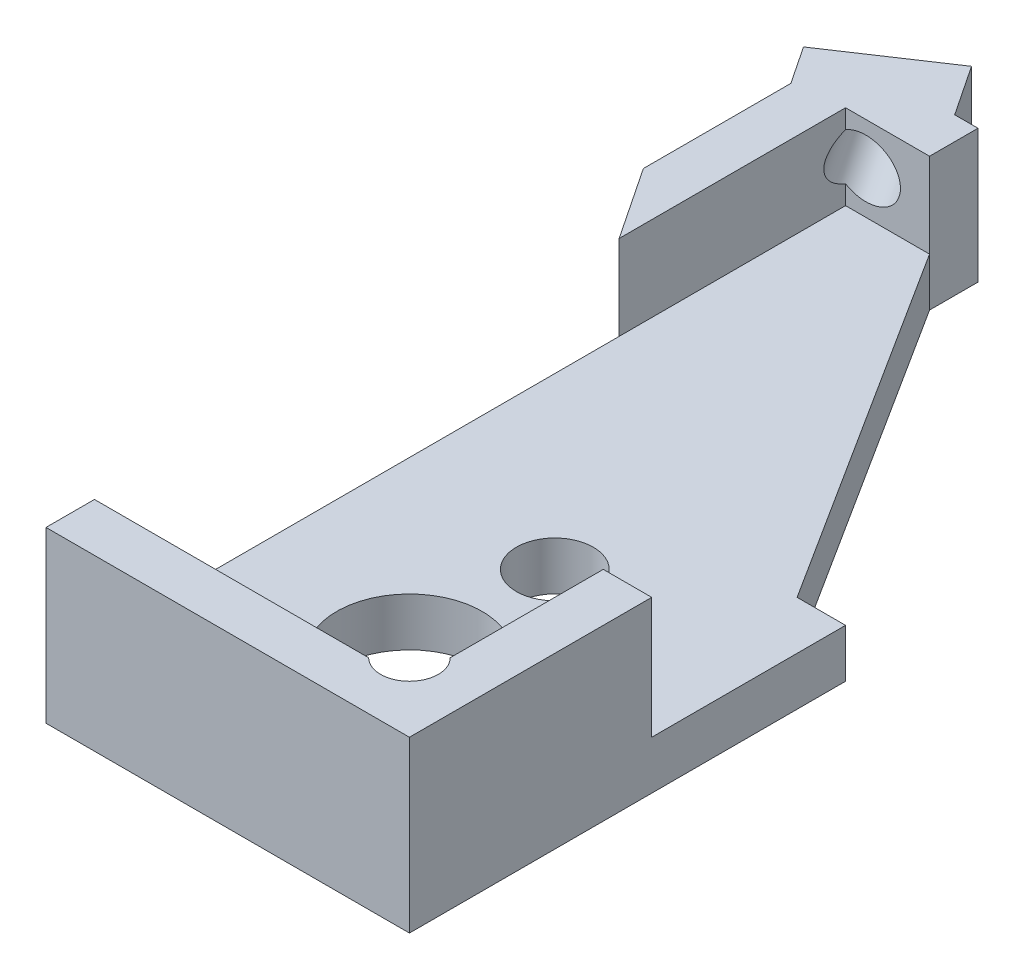
ISO-10303-21;
HEADER;
FILE_DESCRIPTION(('STEP AP214'),'2;1');
FILE_NAME('part.step','',(''),(''),'','','');
FILE_SCHEMA(('AUTOMOTIVE_DESIGN { 1 0 10303 214 1 1 1 1 }'));
ENDSEC;
DATA;
#1=APPLICATION_CONTEXT('core data for automotive mechanical design processes');
#2=APPLICATION_PROTOCOL_DEFINITION('international standard','automotive_design',2000,#1);
#3=PRODUCT_CONTEXT('',#1,'mechanical');
#4=PRODUCT('Part','Part','',(#3));
#5=PRODUCT_RELATED_PRODUCT_CATEGORY('part','',(#4));
#6=PRODUCT_DEFINITION_FORMATION('','',#4);
#7=PRODUCT_DEFINITION_CONTEXT('part definition',#1,'design');
#8=PRODUCT_DEFINITION('design','',#6,#7);
#9=PRODUCT_DEFINITION_SHAPE('','',#8);
#10=(LENGTH_UNIT() NAMED_UNIT(*) SI_UNIT(.MILLI.,.METRE.));
#11=(NAMED_UNIT(*) PLANE_ANGLE_UNIT() SI_UNIT($,.RADIAN.));
#12=(NAMED_UNIT(*) SI_UNIT($,.STERADIAN.) SOLID_ANGLE_UNIT());
#13=UNCERTAINTY_MEASURE_WITH_UNIT(LENGTH_MEASURE(1.E-05),#10,'distance_accuracy_value','');
#14=(GEOMETRIC_REPRESENTATION_CONTEXT(3) GLOBAL_UNCERTAINTY_ASSIGNED_CONTEXT((#13)) GLOBAL_UNIT_ASSIGNED_CONTEXT((#10,
#11,#12)) REPRESENTATION_CONTEXT('',''));
#15=CARTESIAN_POINT('',(0.,0.,0.));
#16=DIRECTION('',(0.,0.,1.));
#17=DIRECTION('',(1.,0.,0.));
#18=AXIS2_PLACEMENT_3D('',#15,#16,#17);
#19=CARTESIAN_POINT('',(-4.25,3.5,-8.75));
#20=DIRECTION('',(1.,0.,0.));
#21=DIRECTION('',(0.,0.,-1.));
#22=AXIS2_PLACEMENT_3D('',#19,#20,#21);
#23=PLANE('',#22);
#24=DIRECTION('',(0.,0.,1.));
#25=VECTOR('',#24,1.);
#26=CARTESIAN_POINT('',(-4.25,0.,-8.75));
#27=LINE('',#26,#25);
#28=CARTESIAN_POINT('',(-4.25,0.,-7.62166032803722));
#29=VERTEX_POINT('',#28);
#30=CARTESIAN_POINT('',(-4.25,0.,-4.57758298094113));
#31=VERTEX_POINT('',#30);
#32=EDGE_CURVE('E316',#29,#31,#27,.T.);
#33=ORIENTED_EDGE('',*,*,#32,.T.);
#34=DIRECTION('',(0.,1.,0.));
#35=VECTOR('',#34,1.);
#36=CARTESIAN_POINT('',(-4.25,-0.001000000000001,-4.57758298094113));
#37=LINE('',#36,#35);
#38=CARTESIAN_POINT('',(-4.25,2.75,-4.57758298094114));
#39=VERTEX_POINT('',#38);
#40=EDGE_CURVE('E221',#31,#39,#37,.T.);
#41=ORIENTED_EDGE('',*,*,#40,.T.);
#42=DIRECTION('',(0.,0.,-1.));
#43=VECTOR('',#42,1.);
#44=CARTESIAN_POINT('',(-4.25,2.75,-8.75));
#45=LINE('',#44,#43);
#46=CARTESIAN_POINT('',(-4.25,2.75,-7.62166032803722));
#47=VERTEX_POINT('',#46);
#48=EDGE_CURVE('E249',#39,#47,#45,.T.);
#49=ORIENTED_EDGE('',*,*,#48,.T.);
#50=DIRECTION('',(0.,-1.,0.));
#51=VECTOR('',#50,1.);
#52=CARTESIAN_POINT('',(-4.25,3.5,-7.62166032803722));
#53=LINE('',#52,#51);
#54=EDGE_CURVE('E272',#47,#29,#53,.T.);
#55=ORIENTED_EDGE('',*,*,#54,.T.);
#56=EDGE_LOOP('',(#33,#41,#49,#55));
#57=FACE_BOUND('',#56,.T.);
#58=ADVANCED_FACE('F37',(#57),#23,.F.);
#59=CARTESIAN_POINT('',(4.25,3.5,8.75));
#60=DIRECTION('',(0.,0.,-1.));
#61=DIRECTION('',(-1.,0.,0.));
#62=AXIS2_PLACEMENT_3D('',#59,#60,#61);
#63=PLANE('',#62);
#64=DIRECTION('',(1.,0.,0.));
#65=VECTOR('',#64,1.);
#66=CARTESIAN_POINT('',(4.25,3.5,8.75));
#67=LINE('',#66,#65);
#68=CARTESIAN_POINT('',(-3.24962944689039,3.5,8.75));
#69=VERTEX_POINT('',#68);
#70=CARTESIAN_POINT('',(4.25,3.5,8.75));
#71=VERTEX_POINT('',#70);
#72=EDGE_CURVE('E324',#69,#71,#67,.T.);
#73=ORIENTED_EDGE('',*,*,#72,.F.);
#74=DIRECTION('',(0.,1.,0.));
#75=VECTOR('',#74,1.);
#76=CARTESIAN_POINT('',(-3.24962944689039,-0.001000000000001,8.75));
#77=LINE('',#76,#75);
#78=CARTESIAN_POINT('',(-3.24962944689039,0.,8.75));
#79=VERTEX_POINT('',#78);
#80=EDGE_CURVE('E218',#79,#69,#77,.T.);
#81=ORIENTED_EDGE('',*,*,#80,.F.);
#82=DIRECTION('',(1.,0.,0.));
#83=VECTOR('',#82,1.);
#84=CARTESIAN_POINT('',(4.25,0.,8.75));
#85=LINE('',#84,#83);
#86=CARTESIAN_POINT('',(4.25,0.,8.75));
#87=VERTEX_POINT('',#86);
#88=EDGE_CURVE('E333',#79,#87,#85,.T.);
#89=ORIENTED_EDGE('',*,*,#88,.T.);
#90=DIRECTION('',(0.,-1.,0.));
#91=VECTOR('',#90,1.);
#92=CARTESIAN_POINT('',(4.25,3.5,8.75));
#93=LINE('',#92,#91);
#94=EDGE_CURVE('E330',#71,#87,#93,.T.);
#95=ORIENTED_EDGE('',*,*,#94,.F.);
#96=EDGE_LOOP('',(#73,#81,#89,#95));
#97=FACE_BOUND('',#96,.T.);
#98=ADVANCED_FACE('F408',(#97),#63,.F.);
#99=CARTESIAN_POINT('',(4.25,3.5,-8.75));
#100=DIRECTION('',(-1.,0.,0.));
#101=DIRECTION('',(0.,0.,1.));
#102=AXIS2_PLACEMENT_3D('',#99,#100,#101);
#103=PLANE('',#102);
#104=DIRECTION('',(0.,0.,-1.));
#105=VECTOR('',#104,1.);
#106=CARTESIAN_POINT('',(4.25,1.,-0.250000000000001));
#107=LINE('',#106,#105);
#108=CARTESIAN_POINT('',(4.25,1.,3.75));
#109=VERTEX_POINT('',#108);
#110=CARTESIAN_POINT('',(4.25,1.,-0.250000000000001));
#111=VERTEX_POINT('',#110);
#112=EDGE_CURVE('E51',#109,#111,#107,.T.);
#113=ORIENTED_EDGE('',*,*,#112,.F.);
#114=DIRECTION('',(0.,1.,0.));
#115=VECTOR('',#114,1.);
#116=CARTESIAN_POINT('',(4.25,1.,3.75));
#117=LINE('',#116,#115);
#118=CARTESIAN_POINT('',(4.25,3.5,3.75));
#119=VERTEX_POINT('',#118);
#120=EDGE_CURVE('E362',#109,#119,#117,.T.);
#121=ORIENTED_EDGE('',*,*,#120,.T.);
#122=DIRECTION('',(0.,0.,-1.));
#123=VECTOR('',#122,1.);
#124=CARTESIAN_POINT('',(4.25,3.5,-8.75));
#125=LINE('',#124,#123);
#126=EDGE_CURVE('E326',#71,#119,#125,.T.);
#127=ORIENTED_EDGE('',*,*,#126,.F.);
#128=ORIENTED_EDGE('',*,*,#94,.T.);
#129=DIRECTION('',(0.,0.,-1.));
#130=VECTOR('',#129,1.);
#131=CARTESIAN_POINT('',(4.25,0.,-8.75));
#132=LINE('',#131,#130);
#133=CARTESIAN_POINT('',(4.25,0.,-0.25));
#134=VERTEX_POINT('',#133);
#135=EDGE_CURVE('E335',#87,#134,#132,.T.);
#136=ORIENTED_EDGE('',*,*,#135,.T.);
#137=DIRECTION('',(0.,1.,0.));
#138=VECTOR('',#137,1.);
#139=CARTESIAN_POINT('',(4.25,-0.001000000000001,-0.250000000000001));
#140=LINE('',#139,#138);
#141=EDGE_CURVE('E205',#134,#111,#140,.T.);
#142=ORIENTED_EDGE('',*,*,#141,.T.);
#143=EDGE_LOOP('',(#113,#121,#127,#128,#136,#142));
#144=FACE_BOUND('',#143,.T.);
#145=ADVANCED_FACE('F410',(#144),#103,.F.);
#146=CARTESIAN_POINT('',(4.25,3.5,-8.75));
#147=DIRECTION('',(0.,0.,1.));
#148=DIRECTION('',(1.,0.,0.));
#149=AXIS2_PLACEMENT_3D('',#146,#147,#148);
#150=PLANE('',#149);
#151=DIRECTION('',(1.,0.,0.));
#152=VECTOR('',#151,1.);
#153=CARTESIAN_POINT('',(4.25,2.75,-8.75));
#154=LINE('',#153,#152);
#155=CARTESIAN_POINT('',(-1.99760038508853,2.75,-8.75));
#156=VERTEX_POINT('',#155);
#157=CARTESIAN_POINT('',(-1.51708677248769,2.75,-8.75));
#158=VERTEX_POINT('',#157);
#159=EDGE_CURVE('E243',#156,#158,#154,.T.);
#160=ORIENTED_EDGE('',*,*,#159,.T.);
#161=DIRECTION('',(0.,1.,0.));
#162=VECTOR('',#161,1.);
#163=CARTESIAN_POINT('',(-1.51708677248769,-0.001000000000001,-8.75));
#164=LINE('',#163,#162);
#165=CARTESIAN_POINT('',(-1.51708677248769,0.,-8.75));
#166=VERTEX_POINT('',#165);
#167=EDGE_CURVE('E59',#166,#158,#164,.T.);
#168=ORIENTED_EDGE('',*,*,#167,.F.);
#169=DIRECTION('',(-1.,0.,0.));
#170=VECTOR('',#169,1.);
#171=CARTESIAN_POINT('',(4.25,0.,-8.75));
#172=LINE('',#171,#170);
#173=CARTESIAN_POINT('',(-1.99760038508853,0.,-8.75));
#174=VERTEX_POINT('',#173);
#175=EDGE_CURVE('E327',#166,#174,#172,.T.);
#176=ORIENTED_EDGE('',*,*,#175,.T.);
#177=DIRECTION('',(0.,1.,0.));
#178=VECTOR('',#177,1.);
#179=CARTESIAN_POINT('',(-1.99760038508853,3.5,-8.75));
#180=LINE('',#179,#178);
#181=EDGE_CURVE('E269',#174,#156,#180,.T.);
#182=ORIENTED_EDGE('',*,*,#181,.T.);
#183=EDGE_LOOP('',(#160,#168,#176,#182));
#184=FACE_BOUND('',#183,.T.);
#185=ADVANCED_FACE('F450',(#184),#150,.F.);
#186=CARTESIAN_POINT('',(0.,3.5,0.));
#187=DIRECTION('',(0.,-1.,0.));
#188=DIRECTION('',(0.,0.,-1.));
#189=AXIS2_PLACEMENT_3D('',#186,#187,#188);
#190=PLANE('',#189);
#191=ORIENTED_EDGE('',*,*,#126,.T.);
#192=DIRECTION('',(1.,0.,0.));
#193=VECTOR('',#192,1.);
#194=CARTESIAN_POINT('',(4.25,3.5,3.75));
#195=LINE('',#194,#193);
#196=CARTESIAN_POINT('',(3.25,3.5,3.75));
#197=VERTEX_POINT('',#196);
#198=EDGE_CURVE('E354',#197,#119,#195,.T.);
#199=ORIENTED_EDGE('',*,*,#198,.F.);
#200=DIRECTION('',(0.,0.,-1.));
#201=VECTOR('',#200,1.);
#202=CARTESIAN_POINT('',(3.25,3.5,-7.75));
#203=LINE('',#202,#201);
#204=CARTESIAN_POINT('',(3.25,3.5,6.90810098864976));
#205=VERTEX_POINT('',#204);
#206=EDGE_CURVE('E306',#205,#197,#203,.T.);
#207=ORIENTED_EDGE('',*,*,#206,.F.);
#208=CARTESIAN_POINT('',(2.82905049432488,3.5,7.32905049432488));
#209=DIRECTION('',(0.,1.,0.));
#210=DIRECTION('',(0.,0.,1.));
#211=AXIS2_PLACEMENT_3D('',#208,#209,#210);
#212=CIRCLE('',#211,0.595312500000001);
#213=CARTESIAN_POINT('',(2.40810098864977,3.5,7.75));
#214=VERTEX_POINT('',#213);
#215=EDGE_CURVE('E290',#214,#205,#212,.T.);
#216=ORIENTED_EDGE('',*,*,#215,.F.);
#217=DIRECTION('',(1.,0.,0.));
#218=VECTOR('',#217,1.);
#219=CARTESIAN_POINT('',(3.25,3.5,7.75));
#220=LINE('',#219,#218);
#221=CARTESIAN_POINT('',(-3.24962944689039,3.5,7.75));
#222=VERTEX_POINT('',#221);
#223=EDGE_CURVE('E303',#222,#214,#220,.T.);
#224=ORIENTED_EDGE('',*,*,#223,.F.);
#225=DIRECTION('',(0.,0.,-1.));
#226=VECTOR('',#225,1.);
#227=CARTESIAN_POINT('',(-3.24962944689039,3.5,-3.07702715127672));
#228=LINE('',#227,#226);
#229=EDGE_CURVE('E215',#69,#222,#228,.T.);
#230=ORIENTED_EDGE('',*,*,#229,.F.);
#231=ORIENTED_EDGE('',*,*,#72,.T.);
#232=EDGE_LOOP('',(#191,#199,#207,#216,#224,#230,#231));
#233=FACE_BOUND('',#232,.T.);
#234=ADVANCED_FACE('F352',(#233),#190,.F.);
#235=CARTESIAN_POINT('',(0.,0.,0.));
#236=DIRECTION('',(0.,-1.,0.));
#237=DIRECTION('',(0.,0.,-1.));
#238=AXIS2_PLACEMENT_3D('',#235,#236,#237);
#239=PLANE('',#238);
#240=DIRECTION('',(0.,0.,1.));
#241=VECTOR('',#240,1.);
#242=CARTESIAN_POINT('',(-1.51708677248769,0.,-7.75));
#243=LINE('',#242,#241);
#244=CARTESIAN_POINT('',(-1.51708677248769,0.,-7.75));
#245=VERTEX_POINT('',#244);
#246=EDGE_CURVE('E368',#166,#245,#243,.T.);
#247=ORIENTED_EDGE('',*,*,#246,.T.);
#248=DIRECTION('',(0.536423654016749,0.,0.843948851181942));
#249=VECTOR('',#248,1.);
#250=CARTESIAN_POINT('',(3.25,0.,-0.250000000000001));
#251=LINE('',#250,#249);
#252=CARTESIAN_POINT('',(3.25,0.,-0.250000000000001));
#253=VERTEX_POINT('',#252);
#254=EDGE_CURVE('E371',#245,#253,#251,.T.);
#255=ORIENTED_EDGE('',*,*,#254,.T.);
#256=DIRECTION('',(1.,0.,0.));
#257=VECTOR('',#256,1.);
#258=CARTESIAN_POINT('',(4.25,0.,-0.250000000000001));
#259=LINE('',#258,#257);
#260=EDGE_CURVE('E197',#253,#134,#259,.T.);
#261=ORIENTED_EDGE('',*,*,#260,.T.);
#262=ORIENTED_EDGE('',*,*,#135,.F.);
#263=ORIENTED_EDGE('',*,*,#88,.F.);
#264=DIRECTION('',(0.,0.,-1.));
#265=VECTOR('',#264,1.);
#266=CARTESIAN_POINT('',(-3.24962944689039,0.,-3.07702715127672));
#267=LINE('',#266,#265);
#268=CARTESIAN_POINT('',(-3.24962944689039,0.,-3.07702715127672));
#269=VERTEX_POINT('',#268);
#270=EDGE_CURVE('E212',#79,#269,#267,.T.);
#271=ORIENTED_EDGE('',*,*,#270,.T.);
#272=DIRECTION('',(-0.554700196225229,0.,-0.832050294337844));
#273=VECTOR('',#272,1.);
#274=CARTESIAN_POINT('',(-4.25,0.,-4.57758298094113));
#275=LINE('',#274,#273);
#276=EDGE_CURVE('E229',#269,#31,#275,.T.);
#277=ORIENTED_EDGE('',*,*,#276,.T.);
#278=ORIENTED_EDGE('',*,*,#32,.F.);
#279=DIRECTION('',(0.554700196225229,0.,0.832050294337844));
#280=VECTOR('',#279,1.);
#281=CARTESIAN_POINT('',(-4.00154138705974,0.,-7.24897240862683));
#282=LINE('',#281,#280);
#283=CARTESIAN_POINT('',(-4.77077215629051,0.,-8.40281856247299));
#284=VERTEX_POINT('',#283);
#285=EDGE_CURVE('E262',#284,#29,#282,.T.);
#286=ORIENTED_EDGE('',*,*,#285,.F.);
#287=DIRECTION('',(-0.832050294337844,0.,0.554700196225229));
#288=VECTOR('',#287,1.);
#289=CARTESIAN_POINT('',(-2.6906464204459,0.,-9.78956905303606));
#290=LINE('',#289,#288);
#291=CARTESIAN_POINT('',(-2.6906464204459,0.,-9.78956905303606));
#292=VERTEX_POINT('',#291);
#293=EDGE_CURVE('E256',#292,#284,#290,.T.);
#294=ORIENTED_EDGE('',*,*,#293,.F.);
#295=DIRECTION('',(-0.55470019622523,0.,-0.832050294337843));
#296=VECTOR('',#295,1.);
#297=CARTESIAN_POINT('',(-2.6906464204459,0.,-9.78956905303606));
#298=LINE('',#297,#296);
#299=EDGE_CURVE('E259',#174,#292,#298,.T.);
#300=ORIENTED_EDGE('',*,*,#299,.F.);
#301=ORIENTED_EDGE('',*,*,#175,.F.);
#302=EDGE_LOOP('',(#247,#255,#261,#262,#263,#271,#277,#278,#286,#294,#300,#301));
#303=FACE_BOUND('',#302,.T.);
#304=CARTESIAN_POINT('',(2.125,0.,6.5));
#305=DIRECTION('',(0.,1.,0.));
#306=DIRECTION('',(0.,0.,1.));
#307=AXIS2_PLACEMENT_3D('',#304,#305,#306);
#308=CIRCLE('',#307,0.79375);
#309=CARTESIAN_POINT('',(2.125,0.,7.29375));
#310=VERTEX_POINT('',#309);
#311=EDGE_CURVE('E275',#310,#310,#308,.T.);
#312=ORIENTED_EDGE('',*,*,#311,.T.);
#313=EDGE_LOOP('',(#312));
#314=FACE_BOUND('',#313,.T.);
#315=CARTESIAN_POINT('',(-1.625,0.,6.5));
#316=DIRECTION('',(0.,1.,0.));
#317=DIRECTION('',(0.,0.,1.));
#318=AXIS2_PLACEMENT_3D('',#315,#316,#317);
#319=CIRCLE('',#318,0.793750000000001);
#320=CARTESIAN_POINT('',(-1.625,0.,7.29375));
#321=VERTEX_POINT('',#320);
#322=EDGE_CURVE('E281',#321,#321,#319,.T.);
#323=ORIENTED_EDGE('',*,*,#322,.T.);
#324=EDGE_LOOP('',(#323));
#325=FACE_BOUND('',#324,.T.);
#326=CARTESIAN_POINT('',(0.25,0.,1.75));
#327=DIRECTION('',(0.,1.,0.));
#328=DIRECTION('',(0.,0.,1.));
#329=AXIS2_PLACEMENT_3D('',#326,#327,#328);
#330=CIRCLE('',#329,0.79375);
#331=CARTESIAN_POINT('',(0.25,0.,2.54375));
#332=VERTEX_POINT('',#331);
#333=EDGE_CURVE('E287',#332,#332,#330,.T.);
#334=ORIENTED_EDGE('',*,*,#333,.T.);
#335=EDGE_LOOP('',(#334));
#336=FACE_BOUND('',#335,.T.);
#337=CARTESIAN_POINT('',(0.250000000000001,0.,4.75));
#338=DIRECTION('',(0.,1.,0.));
#339=DIRECTION('',(0.,0.,1.));
#340=AXIS2_PLACEMENT_3D('',#337,#338,#339);
#341=CIRCLE('',#340,1.5);
#342=CARTESIAN_POINT('',(0.250000000000001,0.,6.25));
#343=VERTEX_POINT('',#342);
#344=EDGE_CURVE('E300',#343,#343,#341,.T.);
#345=ORIENTED_EDGE('',*,*,#344,.T.);
#346=EDGE_LOOP('',(#345));
#347=FACE_BOUND('',#346,.T.);
#348=ADVANCED_FACE('F402',(#303,#314,#325,#336,#347),#239,.T.);
#349=CARTESIAN_POINT('',(0.,1.,0.));
#350=DIRECTION('',(0.,-1.,0.));
#351=DIRECTION('',(0.,0.,-1.));
#352=AXIS2_PLACEMENT_3D('',#349,#350,#351);
#353=PLANE('',#352);
#354=CARTESIAN_POINT('',(2.125,1.,6.5));
#355=DIRECTION('',(0.,1.,0.));
#356=DIRECTION('',(0.,0.,1.));
#357=AXIS2_PLACEMENT_3D('',#354,#355,#356);
#358=CIRCLE('',#357,0.79375);
#359=CARTESIAN_POINT('',(2.125,1.,7.29375));
#360=VERTEX_POINT('',#359);
#361=EDGE_CURVE('E274',#360,#360,#358,.T.);
#362=ORIENTED_EDGE('',*,*,#361,.F.);
#363=EDGE_LOOP('',(#362));
#364=FACE_BOUND('',#363,.T.);
#365=CARTESIAN_POINT('',(-1.625,1.,6.5));
#366=DIRECTION('',(0.,1.,0.));
#367=DIRECTION('',(0.,0.,1.));
#368=AXIS2_PLACEMENT_3D('',#365,#366,#367);
#369=CIRCLE('',#368,0.793750000000001);
#370=CARTESIAN_POINT('',(-1.625,1.,7.29375));
#371=VERTEX_POINT('',#370);
#372=EDGE_CURVE('E278',#371,#371,#369,.T.);
#373=ORIENTED_EDGE('',*,*,#372,.F.);
#374=EDGE_LOOP('',(#373));
#375=FACE_BOUND('',#374,.T.);
#376=CARTESIAN_POINT('',(0.25,1.,1.75));
#377=DIRECTION('',(0.,1.,0.));
#378=DIRECTION('',(0.,0.,1.));
#379=AXIS2_PLACEMENT_3D('',#376,#377,#378);
#380=CIRCLE('',#379,0.79375);
#381=CARTESIAN_POINT('',(0.25,1.,2.54375));
#382=VERTEX_POINT('',#381);
#383=EDGE_CURVE('E284',#382,#382,#380,.T.);
#384=ORIENTED_EDGE('',*,*,#383,.F.);
#385=EDGE_LOOP('',(#384));
#386=FACE_BOUND('',#385,.T.);
#387=CARTESIAN_POINT('',(0.250000000000001,1.,4.75));
#388=DIRECTION('',(0.,1.,0.));
#389=DIRECTION('',(0.,0.,1.));
#390=AXIS2_PLACEMENT_3D('',#387,#388,#389);
#391=CIRCLE('',#390,1.5);
#392=CARTESIAN_POINT('',(0.250000000000001,1.,6.25));
#393=VERTEX_POINT('',#392);
#394=EDGE_CURVE('E299',#393,#393,#391,.T.);
#395=ORIENTED_EDGE('',*,*,#394,.F.);
#396=EDGE_LOOP('',(#395));
#397=FACE_BOUND('',#396,.T.);
#398=DIRECTION('',(0.,0.,-1.));
#399=VECTOR('',#398,1.);
#400=CARTESIAN_POINT('',(3.25,1.,-7.75));
#401=LINE('',#400,#399);
#402=CARTESIAN_POINT('',(3.25,1.,6.90810098864976));
#403=VERTEX_POINT('',#402);
#404=CARTESIAN_POINT('',(3.25,1.,3.75));
#405=VERTEX_POINT('',#404);
#406=EDGE_CURVE('E312',#403,#405,#401,.T.);
#407=ORIENTED_EDGE('',*,*,#406,.T.);
#408=DIRECTION('',(1.,0.,0.));
#409=VECTOR('',#408,1.);
#410=CARTESIAN_POINT('',(4.25,1.,3.75));
#411=LINE('',#410,#409);
#412=EDGE_CURVE('E183',#405,#109,#411,.T.);
#413=ORIENTED_EDGE('',*,*,#412,.T.);
#414=ORIENTED_EDGE('',*,*,#112,.T.);
#415=DIRECTION('',(-1.,0.,0.));
#416=VECTOR('',#415,1.);
#417=CARTESIAN_POINT('',(4.25,1.,-0.250000000000001));
#418=LINE('',#417,#416);
#419=CARTESIAN_POINT('',(3.25,1.,-0.250000000000001));
#420=VERTEX_POINT('',#419);
#421=EDGE_CURVE('E174',#111,#420,#418,.T.);
#422=ORIENTED_EDGE('',*,*,#421,.T.);
#423=DIRECTION('',(0.536423654016749,0.,0.843948851181942));
#424=VECTOR('',#423,1.);
#425=CARTESIAN_POINT('',(3.25,1.,-0.250000000000001));
#426=LINE('',#425,#424);
#427=CARTESIAN_POINT('',(-1.51708677248769,1.,-7.75));
#428=VERTEX_POINT('',#427);
#429=EDGE_CURVE('E178',#428,#420,#426,.T.);
#430=ORIENTED_EDGE('',*,*,#429,.F.);
#431=DIRECTION('',(-1.,0.,0.));
#432=VECTOR('',#431,1.);
#433=CARTESIAN_POINT('',(3.25,1.,-7.75));
#434=LINE('',#433,#432);
#435=CARTESIAN_POINT('',(-3.25,1.,-7.75));
#436=VERTEX_POINT('',#435);
#437=EDGE_CURVE('E318',#428,#436,#434,.T.);
#438=ORIENTED_EDGE('',*,*,#437,.T.);
#439=DIRECTION('',(0.,0.,1.));
#440=VECTOR('',#439,1.);
#441=CARTESIAN_POINT('',(-3.25,1.,-7.75));
#442=LINE('',#441,#440);
#443=CARTESIAN_POINT('',(-3.25,1.,-3.07758298094113));
#444=VERTEX_POINT('',#443);
#445=EDGE_CURVE('E313',#436,#444,#442,.T.);
#446=ORIENTED_EDGE('',*,*,#445,.T.);
#447=DIRECTION('',(-0.554700196225229,0.,-0.832050294337844));
#448=VECTOR('',#447,1.);
#449=CARTESIAN_POINT('',(-4.25,1.,-4.57758298094113));
#450=LINE('',#449,#448);
#451=CARTESIAN_POINT('',(-3.24962944689039,1.,-3.07702715127672));
#452=VERTEX_POINT('',#451);
#453=EDGE_CURVE('E227',#452,#444,#450,.T.);
#454=ORIENTED_EDGE('',*,*,#453,.F.);
#455=DIRECTION('',(0.,0.,-1.));
#456=VECTOR('',#455,1.);
#457=CARTESIAN_POINT('',(-3.24962944689039,1.,-3.07702715127672));
#458=LINE('',#457,#456);
#459=CARTESIAN_POINT('',(-3.24962944689039,1.,7.75));
#460=VERTEX_POINT('',#459);
#461=EDGE_CURVE('E210',#460,#452,#458,.T.);
#462=ORIENTED_EDGE('',*,*,#461,.F.);
#463=DIRECTION('',(1.,0.,0.));
#464=VECTOR('',#463,1.);
#465=CARTESIAN_POINT('',(3.25,1.,7.75));
#466=LINE('',#465,#464);
#467=CARTESIAN_POINT('',(2.40810098864977,1.,7.75));
#468=VERTEX_POINT('',#467);
#469=EDGE_CURVE('E309',#460,#468,#466,.T.);
#470=ORIENTED_EDGE('',*,*,#469,.T.);
#471=CARTESIAN_POINT('',(2.82905049432488,1.,7.32905049432488));
#472=DIRECTION('',(0.,-1.,0.));
#473=DIRECTION('',(0.,0.,-1.));
#474=AXIS2_PLACEMENT_3D('',#471,#472,#473);
#475=CIRCLE('',#474,0.595312500000001);
#476=EDGE_CURVE('E294',#468,#403,#475,.F.);
#477=ORIENTED_EDGE('',*,*,#476,.T.);
#478=EDGE_LOOP('',(#407,#413,#414,#422,#430,#438,#446,#454,#462,#470,#477));
#479=FACE_BOUND('',#478,.T.);
#480=ADVANCED_FACE('F177',(#364,#375,#386,#397,#479),#353,.F.);
#481=CARTESIAN_POINT('',(3.25,-16.8077363139716,7.75));
#482=DIRECTION('',(0.,0.,1.));
#483=DIRECTION('',(1.,0.,0.));
#484=AXIS2_PLACEMENT_3D('',#481,#482,#483);
#485=PLANE('',#484);
#486=ORIENTED_EDGE('',*,*,#469,.F.);
#487=DIRECTION('',(0.,-1.,0.));
#488=VECTOR('',#487,1.);
#489=CARTESIAN_POINT('',(-3.24962944689039,-0.001000000000001,7.75));
#490=LINE('',#489,#488);
#491=EDGE_CURVE('E208',#222,#460,#490,.T.);
#492=ORIENTED_EDGE('',*,*,#491,.F.);
#493=ORIENTED_EDGE('',*,*,#223,.T.);
#494=DIRECTION('',(0.,1.,0.));
#495=VECTOR('',#494,1.);
#496=CARTESIAN_POINT('',(2.40810098864977,-0.68379802270047,7.75));
#497=LINE('',#496,#495);
#498=EDGE_CURVE('E296',#214,#468,#497,.F.);
#499=ORIENTED_EDGE('',*,*,#498,.T.);
#500=EDGE_LOOP('',(#486,#492,#493,#499));
#501=FACE_BOUND('',#500,.T.);
#502=ADVANCED_FACE('F415',(#501),#485,.F.);
#503=CARTESIAN_POINT('',(3.25,-16.8077363139716,-7.75));
#504=DIRECTION('',(1.,0.,0.));
#505=DIRECTION('',(0.,0.,-1.));
#506=AXIS2_PLACEMENT_3D('',#503,#504,#505);
#507=PLANE('',#506);
#508=ORIENTED_EDGE('',*,*,#206,.T.);
#509=DIRECTION('',(0.,1.,0.));
#510=VECTOR('',#509,1.);
#511=CARTESIAN_POINT('',(3.25,1.,3.75));
#512=LINE('',#511,#510);
#513=EDGE_CURVE('E365',#405,#197,#512,.T.);
#514=ORIENTED_EDGE('',*,*,#513,.F.);
#515=ORIENTED_EDGE('',*,*,#406,.F.);
#516=DIRECTION('',(0.,1.,0.));
#517=VECTOR('',#516,1.);
#518=CARTESIAN_POINT('',(3.25,-0.68379802270047,6.90810098864976));
#519=LINE('',#518,#517);
#520=EDGE_CURVE('E44',#403,#205,#519,.T.);
#521=ORIENTED_EDGE('',*,*,#520,.T.);
#522=EDGE_LOOP('',(#508,#514,#515,#521));
#523=FACE_BOUND('',#522,.T.);
#524=ADVANCED_FACE('F345',(#523),#507,.F.);
#525=CARTESIAN_POINT('',(3.25,-16.8077363139716,-7.75));
#526=DIRECTION('',(0.,0.,-1.));
#527=DIRECTION('',(-1.,0.,0.));
#528=AXIS2_PLACEMENT_3D('',#525,#526,#527);
#529=PLANE('',#528);
#530=ORIENTED_EDGE('',*,*,#437,.F.);
#531=DIRECTION('',(0.,-1.,0.));
#532=VECTOR('',#531,1.);
#533=CARTESIAN_POINT('',(-1.51708677248769,-0.001000000000001,-7.75));
#534=LINE('',#533,#532);
#535=CARTESIAN_POINT('',(-1.51708677248769,2.75,-7.75));
#536=VERTEX_POINT('',#535);
#537=EDGE_CURVE('E364',#536,#428,#534,.T.);
#538=ORIENTED_EDGE('',*,*,#537,.F.);
#539=DIRECTION('',(-1.,0.,0.));
#540=VECTOR('',#539,1.);
#541=CARTESIAN_POINT('',(3.25,2.75,-7.75));
#542=LINE('',#541,#540);
#543=CARTESIAN_POINT('',(-3.25,2.75,-7.75));
#544=VERTEX_POINT('',#543);
#545=EDGE_CURVE('E254',#536,#544,#542,.T.);
#546=ORIENTED_EDGE('',*,*,#545,.T.);
#547=DIRECTION('',(0.,1.,0.));
#548=VECTOR('',#547,1.);
#549=CARTESIAN_POINT('',(-3.25,-16.8077363139716,-7.75));
#550=LINE('',#549,#548);
#551=CARTESIAN_POINT('',(-3.25,2.35928589904808,-7.75));
#552=VERTEX_POINT('',#551);
#553=EDGE_CURVE('E320',#552,#544,#550,.T.);
#554=ORIENTED_EDGE('',*,*,#553,.F.);
#555=CARTESIAN_POINT('',(-2.83324674986519,1.875,-7.75));
#556=DIRECTION('',(0.,0.,-1.));
#557=DIRECTION('',(-1.,0.,0.));
#558=AXIS2_PLACEMENT_3D('',#555,#556,#557);
#559=ELLIPSE('',#558,0.715858168734871,0.595629999999999);
#560=CARTESIAN_POINT('',(-3.25,1.39071410095189,-7.75));
#561=VERTEX_POINT('',#560);
#562=EDGE_CURVE('E238',#552,#561,#559,.T.);
#563=ORIENTED_EDGE('',*,*,#562,.T.);
#564=EDGE_CURVE('E317',#436,#561,#550,.T.);
#565=ORIENTED_EDGE('',*,*,#564,.F.);
#566=EDGE_LOOP('',(#530,#538,#546,#554,#563,#565));
#567=FACE_BOUND('',#566,.T.);
#568=ADVANCED_FACE('F379',(#567),#529,.F.);
#569=CARTESIAN_POINT('',(-3.25,-16.8077363139716,-7.75));
#570=DIRECTION('',(-1.,0.,0.));
#571=DIRECTION('',(0.,0.,1.));
#572=AXIS2_PLACEMENT_3D('',#569,#570,#571);
#573=PLANE('',#572);
#574=DIRECTION('',(0.,0.,1.));
#575=VECTOR('',#574,1.);
#576=CARTESIAN_POINT('',(-3.25,2.75,-7.75));
#577=LINE('',#576,#575);
#578=CARTESIAN_POINT('',(-3.25,2.75,-3.07758298094113));
#579=VERTEX_POINT('',#578);
#580=EDGE_CURVE('E251',#544,#579,#577,.T.);
#581=ORIENTED_EDGE('',*,*,#580,.T.);
#582=DIRECTION('',(0.,1.,0.));
#583=VECTOR('',#582,1.);
#584=CARTESIAN_POINT('',(-3.25,-0.001000000000001,-3.07758298094113));
#585=LINE('',#584,#583);
#586=EDGE_CURVE('E193',#444,#579,#585,.T.);
#587=ORIENTED_EDGE('',*,*,#586,.F.);
#588=ORIENTED_EDGE('',*,*,#445,.F.);
#589=ORIENTED_EDGE('',*,*,#564,.T.);
#590=CARTESIAN_POINT('',(-3.25,1.875,-8.37512987520221));
#591=DIRECTION('',(-1.,0.,0.));
#592=DIRECTION('',(0.,0.,-1.));
#593=AXIS2_PLACEMENT_3D('',#590,#591,#592);
#594=ELLIPSE('',#593,1.0737872531023,0.595629999999999);
#595=EDGE_CURVE('E235',#561,#552,#594,.T.);
#596=ORIENTED_EDGE('',*,*,#595,.T.);
#597=ORIENTED_EDGE('',*,*,#553,.T.);
#598=EDGE_LOOP('',(#581,#587,#588,#589,#596,#597));
#599=FACE_BOUND('',#598,.T.);
#600=ADVANCED_FACE('F389',(#599),#573,.F.);
#601=CARTESIAN_POINT('',(0.250000000000001,0.,4.75));
#602=DIRECTION('',(0.,1.,0.));
#603=DIRECTION('',(0.,0.,1.));
#604=AXIS2_PLACEMENT_3D('',#601,#602,#603);
#605=CYLINDRICAL_SURFACE('',#604,1.5);
#606=ORIENTED_EDGE('',*,*,#344,.F.);
#607=EDGE_LOOP('',(#606));
#608=FACE_BOUND('',#607,.T.);
#609=ORIENTED_EDGE('',*,*,#394,.T.);
#610=EDGE_LOOP('',(#609));
#611=FACE_BOUND('',#610,.T.);
#612=ADVANCED_FACE('F546',(#608,#611),#605,.F.);
#613=CARTESIAN_POINT('',(2.82905049432488,-0.68379802270047,7.32905049432488));
#614=DIRECTION('',(0.,1.,0.));
#615=DIRECTION('',(0.,0.,1.));
#616=AXIS2_PLACEMENT_3D('',#613,#614,#615);
#617=CYLINDRICAL_SURFACE('',#616,0.595312500000001);
#618=ORIENTED_EDGE('',*,*,#215,.T.);
#619=ORIENTED_EDGE('',*,*,#520,.F.);
#620=ORIENTED_EDGE('',*,*,#476,.F.);
#621=ORIENTED_EDGE('',*,*,#498,.F.);
#622=EDGE_LOOP('',(#618,#619,#620,#621));
#623=FACE_BOUND('',#622,.T.);
#624=ADVANCED_FACE('F413',(#623),#617,.F.);
#625=CARTESIAN_POINT('',(0.25,0.,1.75));
#626=DIRECTION('',(0.,1.,0.));
#627=DIRECTION('',(0.,0.,1.));
#628=AXIS2_PLACEMENT_3D('',#625,#626,#627);
#629=CYLINDRICAL_SURFACE('',#628,0.79375);
#630=ORIENTED_EDGE('',*,*,#333,.F.);
#631=EDGE_LOOP('',(#630));
#632=FACE_BOUND('',#631,.T.);
#633=ORIENTED_EDGE('',*,*,#383,.T.);
#634=EDGE_LOOP('',(#633));
#635=FACE_BOUND('',#634,.T.);
#636=ADVANCED_FACE('F539',(#632,#635),#629,.F.);
#637=CARTESIAN_POINT('',(-1.625,0.,6.5));
#638=DIRECTION('',(0.,1.,0.));
#639=DIRECTION('',(0.,0.,1.));
#640=AXIS2_PLACEMENT_3D('',#637,#638,#639);
#641=CYLINDRICAL_SURFACE('',#640,0.793750000000001);
#642=ORIENTED_EDGE('',*,*,#322,.F.);
#643=EDGE_LOOP('',(#642));
#644=FACE_BOUND('',#643,.T.);
#645=ORIENTED_EDGE('',*,*,#372,.T.);
#646=EDGE_LOOP('',(#645));
#647=FACE_BOUND('',#646,.T.);
#648=ADVANCED_FACE('F535',(#644,#647),#641,.F.);
#649=CARTESIAN_POINT('',(2.125,0.,6.5));
#650=DIRECTION('',(0.,1.,0.));
#651=DIRECTION('',(0.,0.,1.));
#652=AXIS2_PLACEMENT_3D('',#649,#650,#651);
#653=CYLINDRICAL_SURFACE('',#652,0.79375);
#654=ORIENTED_EDGE('',*,*,#311,.F.);
#655=EDGE_LOOP('',(#654));
#656=FACE_BOUND('',#655,.T.);
#657=ORIENTED_EDGE('',*,*,#361,.T.);
#658=EDGE_LOOP('',(#657));
#659=FACE_BOUND('',#658,.T.);
#660=ADVANCED_FACE('F531',(#656,#659),#653,.F.);
#661=CARTESIAN_POINT('',(-2.6906464204459,-3.81752063551709,-9.78956905303606));
#662=DIRECTION('',(-0.554700196225229,0.,-0.832050294337844));
#663=DIRECTION('',(-0.832050294337844,0.,0.554700196225229));
#664=AXIS2_PLACEMENT_3D('',#661,#662,#663);
#665=PLANE('',#664);
#666=CARTESIAN_POINT('',(-3.73070928836821,1.875,-9.09619380775452));
#667=DIRECTION('',(-0.55470019622523,0.,-0.832050294337843));
#668=DIRECTION('',(-0.832050294337843,0.,0.55470019622523));
#669=AXIS2_PLACEMENT_3D('',#666,#667,#668);
#670=CIRCLE('',#669,0.595629999999999);
#671=CARTESIAN_POINT('',(-4.22630340518466,1.875,-8.76579772987689));
#672=VERTEX_POINT('',#671);
#673=EDGE_CURVE('E232',#672,#672,#670,.T.);
#674=ORIENTED_EDGE('',*,*,#673,.F.);
#675=EDGE_LOOP('',(#674));
#676=FACE_BOUND('',#675,.T.);
#677=DIRECTION('',(-0.832050294337844,0.,0.554700196225229));
#678=VECTOR('',#677,1.);
#679=CARTESIAN_POINT('',(-2.6906464204459,2.75,-9.78956905303606));
#680=LINE('',#679,#678);
#681=CARTESIAN_POINT('',(-2.6906464204459,2.75,-9.78956905303606));
#682=VERTEX_POINT('',#681);
#683=CARTESIAN_POINT('',(-4.77077215629051,2.75,-8.40281856247299));
#684=VERTEX_POINT('',#683);
#685=EDGE_CURVE('E241',#682,#684,#680,.T.);
#686=ORIENTED_EDGE('',*,*,#685,.F.);
#687=DIRECTION('',(0.,1.,0.));
#688=VECTOR('',#687,1.);
#689=CARTESIAN_POINT('',(-2.6906464204459,-3.81752063551709,-9.78956905303606));
#690=LINE('',#689,#688);
#691=EDGE_CURVE('E261',#292,#682,#690,.T.);
#692=ORIENTED_EDGE('',*,*,#691,.F.);
#693=ORIENTED_EDGE('',*,*,#293,.T.);
#694=DIRECTION('',(0.,1.,0.));
#695=VECTOR('',#694,1.);
#696=CARTESIAN_POINT('',(-4.77077215629051,-3.81752063551709,-8.40281856247299));
#697=LINE('',#696,#695);
#698=EDGE_CURVE('E258',#284,#684,#697,.T.);
#699=ORIENTED_EDGE('',*,*,#698,.T.);
#700=EDGE_LOOP('',(#686,#692,#693,#699));
#701=FACE_BOUND('',#700,.T.);
#702=ADVANCED_FACE('F443',(#676,#701),#665,.T.);
#703=CARTESIAN_POINT('',(-4.00154138705974,-3.81752063551709,-7.24897240862683));
#704=DIRECTION('',(-0.832050294337844,0.,0.554700196225229));
#705=DIRECTION('',(0.554700196225229,0.,0.832050294337844));
#706=AXIS2_PLACEMENT_3D('',#703,#704,#705);
#707=PLANE('',#706);
#708=DIRECTION('',(0.554700196225229,0.,0.832050294337844));
#709=VECTOR('',#708,1.);
#710=CARTESIAN_POINT('',(-4.00154138705974,2.75,-7.24897240862683));
#711=LINE('',#710,#709);
#712=EDGE_CURVE('E246',#684,#47,#711,.T.);
#713=ORIENTED_EDGE('',*,*,#712,.F.);
#714=ORIENTED_EDGE('',*,*,#698,.F.);
#715=ORIENTED_EDGE('',*,*,#285,.T.);
#716=ORIENTED_EDGE('',*,*,#54,.F.);
#717=EDGE_LOOP('',(#713,#714,#715,#716));
#718=FACE_BOUND('',#717,.T.);
#719=ADVANCED_FACE('F440',(#718),#707,.T.);
#720=CARTESIAN_POINT('',(-2.6906464204459,-3.81752063551709,-9.78956905303606));
#721=DIRECTION('',(0.832050294337843,0.,-0.55470019622523));
#722=DIRECTION('',(-0.55470019622523,0.,-0.832050294337843));
#723=AXIS2_PLACEMENT_3D('',#720,#721,#722);
#724=PLANE('',#723);
#725=DIRECTION('',(-0.55470019622523,0.,-0.832050294337843));
#726=VECTOR('',#725,1.);
#727=CARTESIAN_POINT('',(-2.6906464204459,2.75,-9.78956905303606));
#728=LINE('',#727,#726);
#729=EDGE_CURVE('E12',#156,#682,#728,.T.);
#730=ORIENTED_EDGE('',*,*,#729,.F.);
#731=ORIENTED_EDGE('',*,*,#181,.F.);
#732=ORIENTED_EDGE('',*,*,#299,.T.);
#733=ORIENTED_EDGE('',*,*,#691,.T.);
#734=EDGE_LOOP('',(#730,#731,#732,#733));
#735=FACE_BOUND('',#734,.T.);
#736=ADVANCED_FACE('F446',(#735),#724,.T.);
#737=CARTESIAN_POINT('',(0.,2.75,0.));
#738=DIRECTION('',(0.,-1.,0.));
#739=DIRECTION('',(0.,0.,-1.));
#740=AXIS2_PLACEMENT_3D('',#737,#738,#739);
#741=PLANE('',#740);
#742=ORIENTED_EDGE('',*,*,#545,.F.);
#743=DIRECTION('',(0.,0.,1.));
#744=VECTOR('',#743,1.);
#745=CARTESIAN_POINT('',(-1.51708677248769,2.75,-7.75));
#746=LINE('',#745,#744);
#747=EDGE_CURVE('E201',#158,#536,#746,.T.);
#748=ORIENTED_EDGE('',*,*,#747,.F.);
#749=ORIENTED_EDGE('',*,*,#159,.F.);
#750=ORIENTED_EDGE('',*,*,#729,.T.);
#751=ORIENTED_EDGE('',*,*,#685,.T.);
#752=ORIENTED_EDGE('',*,*,#712,.T.);
#753=ORIENTED_EDGE('',*,*,#48,.F.);
#754=DIRECTION('',(-0.554700196225229,0.,-0.832050294337844));
#755=VECTOR('',#754,1.);
#756=CARTESIAN_POINT('',(-4.25,2.75,-4.57758298094113));
#757=LINE('',#756,#755);
#758=EDGE_CURVE('E220',#579,#39,#757,.T.);
#759=ORIENTED_EDGE('',*,*,#758,.F.);
#760=ORIENTED_EDGE('',*,*,#580,.F.);
#761=EDGE_LOOP('',(#742,#748,#749,#750,#751,#752,#753,#759,#760));
#762=FACE_BOUND('',#761,.T.);
#763=ADVANCED_FACE('F384',(#762),#741,.F.);
#764=CARTESIAN_POINT('',(-3.73070928836821,1.875,-9.09619380775452));
#765=DIRECTION('',(-0.55470019622523,0.,-0.832050294337843));
#766=DIRECTION('',(-0.832050294337843,0.,0.55470019622523));
#767=AXIS2_PLACEMENT_3D('',#764,#765,#766);
#768=CYLINDRICAL_SURFACE('',#767,0.595629999999999);
#769=ORIENTED_EDGE('',*,*,#673,.T.);
#770=EDGE_LOOP('',(#769));
#771=FACE_BOUND('',#770,.T.);
#772=ORIENTED_EDGE('',*,*,#595,.F.);
#773=ORIENTED_EDGE('',*,*,#562,.F.);
#774=EDGE_LOOP('',(#772,#773));
#775=FACE_BOUND('',#774,.T.);
#776=ADVANCED_FACE('F519',(#771,#775),#768,.F.);
#777=CARTESIAN_POINT('',(-3.24962944689039,-0.001000000000001,-3.07702715127672));
#778=DIRECTION('',(1.,0.,0.));
#779=DIRECTION('',(0.,0.,-1.));
#780=AXIS2_PLACEMENT_3D('',#777,#778,#779);
#781=PLANE('',#780);
#782=ORIENTED_EDGE('',*,*,#80,.T.);
#783=ORIENTED_EDGE('',*,*,#229,.T.);
#784=ORIENTED_EDGE('',*,*,#491,.T.);
#785=ORIENTED_EDGE('',*,*,#461,.T.);
#786=DIRECTION('',(0.,1.,0.));
#787=VECTOR('',#786,1.);
#788=CARTESIAN_POINT('',(-3.24962944689039,-0.001000000000001,-3.07702715127672));
#789=LINE('',#788,#787);
#790=EDGE_CURVE('E217',#269,#452,#789,.T.);
#791=ORIENTED_EDGE('',*,*,#790,.F.);
#792=ORIENTED_EDGE('',*,*,#270,.F.);
#793=EDGE_LOOP('',(#782,#783,#784,#785,#791,#792));
#794=FACE_BOUND('',#793,.T.);
#795=ADVANCED_FACE('F399',(#794),#781,.F.);
#796=CARTESIAN_POINT('',(-4.25,-0.001000000000001,-4.57758298094113));
#797=DIRECTION('',(0.832050294337844,0.,-0.554700196225229));
#798=DIRECTION('',(-0.554700196225229,0.,-0.832050294337844));
#799=AXIS2_PLACEMENT_3D('',#796,#797,#798);
#800=PLANE('',#799);
#801=ORIENTED_EDGE('',*,*,#790,.T.);
#802=ORIENTED_EDGE('',*,*,#453,.T.);
#803=ORIENTED_EDGE('',*,*,#586,.T.);
#804=ORIENTED_EDGE('',*,*,#758,.T.);
#805=ORIENTED_EDGE('',*,*,#40,.F.);
#806=ORIENTED_EDGE('',*,*,#276,.F.);
#807=EDGE_LOOP('',(#801,#802,#803,#804,#805,#806));
#808=FACE_BOUND('',#807,.T.);
#809=ADVANCED_FACE('F396',(#808),#800,.F.);
#810=CARTESIAN_POINT('',(3.25,-0.001000000000001,-0.250000000000001));
#811=DIRECTION('',(-0.843948851181942,0.,0.536423654016749));
#812=DIRECTION('',(0.536423654016749,0.,0.843948851181942));
#813=AXIS2_PLACEMENT_3D('',#810,#811,#812);
#814=PLANE('',#813);
#815=DIRECTION('',(0.,1.,0.));
#816=VECTOR('',#815,1.);
#817=CARTESIAN_POINT('',(-1.51708677248769,-0.001000000000001,-7.75));
#818=LINE('',#817,#816);
#819=EDGE_CURVE('E192',#245,#428,#818,.T.);
#820=ORIENTED_EDGE('',*,*,#819,.T.);
#821=ORIENTED_EDGE('',*,*,#429,.T.);
#822=DIRECTION('',(0.,1.,0.));
#823=VECTOR('',#822,1.);
#824=CARTESIAN_POINT('',(3.25,-0.001000000000001,-0.250000000000001));
#825=LINE('',#824,#823);
#826=EDGE_CURVE('E189',#253,#420,#825,.T.);
#827=ORIENTED_EDGE('',*,*,#826,.F.);
#828=ORIENTED_EDGE('',*,*,#254,.F.);
#829=EDGE_LOOP('',(#820,#821,#827,#828));
#830=FACE_BOUND('',#829,.T.);
#831=ADVANCED_FACE('F188',(#830),#814,.F.);
#832=CARTESIAN_POINT('',(-1.51708677248769,-0.001000000000001,-7.75));
#833=DIRECTION('',(-1.,0.,0.));
#834=DIRECTION('',(0.,0.,1.));
#835=AXIS2_PLACEMENT_3D('',#832,#833,#834);
#836=PLANE('',#835);
#837=ORIENTED_EDGE('',*,*,#167,.T.);
#838=ORIENTED_EDGE('',*,*,#747,.T.);
#839=ORIENTED_EDGE('',*,*,#537,.T.);
#840=ORIENTED_EDGE('',*,*,#819,.F.);
#841=ORIENTED_EDGE('',*,*,#246,.F.);
#842=EDGE_LOOP('',(#837,#838,#839,#840,#841));
#843=FACE_BOUND('',#842,.T.);
#844=ADVANCED_FACE('F375',(#843),#836,.F.);
#845=CARTESIAN_POINT('',(4.25,-0.001000000000001,-0.250000000000001));
#846=DIRECTION('',(0.,0.,1.));
#847=DIRECTION('',(1.,0.,0.));
#848=AXIS2_PLACEMENT_3D('',#845,#846,#847);
#849=PLANE('',#848);
#850=ORIENTED_EDGE('',*,*,#826,.T.);
#851=ORIENTED_EDGE('',*,*,#421,.F.);
#852=ORIENTED_EDGE('',*,*,#141,.F.);
#853=ORIENTED_EDGE('',*,*,#260,.F.);
#854=EDGE_LOOP('',(#850,#851,#852,#853));
#855=FACE_BOUND('',#854,.T.);
#856=ADVANCED_FACE('F195',(#855),#849,.F.);
#857=CARTESIAN_POINT('',(4.25,1.,3.75));
#858=DIRECTION('',(0.,0.,1.));
#859=DIRECTION('',(1.,0.,0.));
#860=AXIS2_PLACEMENT_3D('',#857,#858,#859);
#861=PLANE('',#860);
#862=ORIENTED_EDGE('',*,*,#198,.T.);
#863=ORIENTED_EDGE('',*,*,#120,.F.);
#864=ORIENTED_EDGE('',*,*,#412,.F.);
#865=ORIENTED_EDGE('',*,*,#513,.T.);
#866=EDGE_LOOP('',(#862,#863,#864,#865));
#867=FACE_BOUND('',#866,.T.);
#868=ADVANCED_FACE('F411',(#867),#861,.F.);
#869=CLOSED_SHELL('',(#58,#98,#145,#185,#234,#348,#480,#502,#524,#568,#600,#612,#624,#636,#648,
#660,#702,#719,#736,#763,#776,#795,#809,#831,#844,#856,#868));
#870=MANIFOLD_SOLID_BREP('B2',#869);
#871=ADVANCED_BREP_SHAPE_REPRESENTATION('',(#18,#870),#14);
#872=SHAPE_DEFINITION_REPRESENTATION(#9,#871);
ENDSEC;
END-ISO-10303-21;
